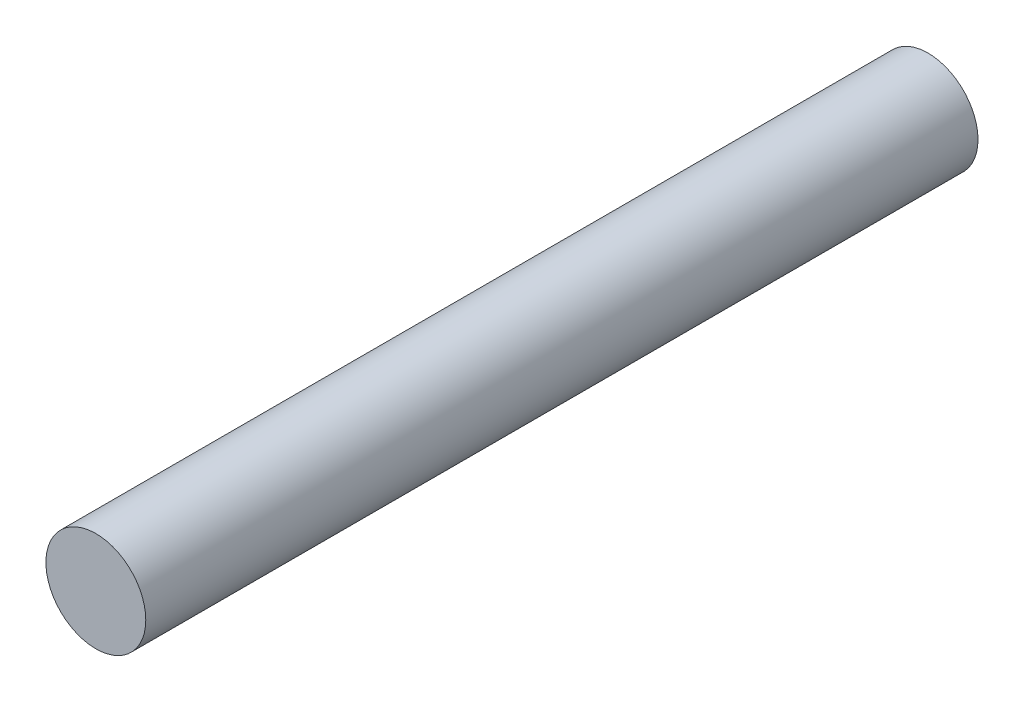
ISO-10303-21;
HEADER;
FILE_DESCRIPTION(('STEP AP214'),'2;1');
FILE_NAME('part.step','',(''),(''),'','','');
FILE_SCHEMA(('AUTOMOTIVE_DESIGN { 1 0 10303 214 1 1 1 1 }'));
ENDSEC;
DATA;
#1=APPLICATION_CONTEXT('core data for automotive mechanical design processes');
#2=APPLICATION_PROTOCOL_DEFINITION('international standard','automotive_design',2000,#1);
#3=PRODUCT_CONTEXT('',#1,'mechanical');
#4=PRODUCT('Part','Part','',(#3));
#5=PRODUCT_RELATED_PRODUCT_CATEGORY('part','',(#4));
#6=PRODUCT_DEFINITION_FORMATION('','',#4);
#7=PRODUCT_DEFINITION_CONTEXT('part definition',#1,'design');
#8=PRODUCT_DEFINITION('design','',#6,#7);
#9=PRODUCT_DEFINITION_SHAPE('','',#8);
#10=(LENGTH_UNIT() NAMED_UNIT(*) SI_UNIT(.MILLI.,.METRE.));
#11=(NAMED_UNIT(*) PLANE_ANGLE_UNIT() SI_UNIT($,.RADIAN.));
#12=(NAMED_UNIT(*) SI_UNIT($,.STERADIAN.) SOLID_ANGLE_UNIT());
#13=UNCERTAINTY_MEASURE_WITH_UNIT(LENGTH_MEASURE(1.E-05),#10,'distance_accuracy_value','');
#14=(GEOMETRIC_REPRESENTATION_CONTEXT(3) GLOBAL_UNCERTAINTY_ASSIGNED_CONTEXT((#13)) GLOBAL_UNIT_ASSIGNED_CONTEXT((#10,
#11,#12)) REPRESENTATION_CONTEXT('',''));
#15=CARTESIAN_POINT('',(0.,0.,0.));
#16=DIRECTION('',(0.,0.,1.));
#17=DIRECTION('',(1.,0.,0.));
#18=AXIS2_PLACEMENT_3D('',#15,#16,#17);
#19=CARTESIAN_POINT('',(0.,0.,50.));
#20=DIRECTION('',(0.,0.,-1.));
#21=DIRECTION('',(-1.,0.,0.));
#22=AXIS2_PLACEMENT_3D('',#19,#20,#21);
#23=CYLINDRICAL_SURFACE('',#22,3.);
#24=CARTESIAN_POINT('',(0.,0.,50.));
#25=DIRECTION('',(0.,0.,1.));
#26=DIRECTION('',(1.,0.,0.));
#27=AXIS2_PLACEMENT_3D('',#24,#25,#26);
#28=CIRCLE('',#27,3.);
#29=CARTESIAN_POINT('',(3.,0.,50.));
#30=VERTEX_POINT('',#29);
#31=EDGE_CURVE('E10',#30,#30,#28,.T.);
#32=ORIENTED_EDGE('',*,*,#31,.F.);
#33=EDGE_LOOP('',(#32));
#34=FACE_BOUND('',#33,.T.);
#35=CARTESIAN_POINT('',(0.,0.,0.));
#36=DIRECTION('',(0.,0.,1.));
#37=DIRECTION('',(1.,0.,0.));
#38=AXIS2_PLACEMENT_3D('',#35,#36,#37);
#39=CIRCLE('',#38,3.);
#40=CARTESIAN_POINT('',(3.,0.,0.));
#41=VERTEX_POINT('',#40);
#42=EDGE_CURVE('E36',#41,#41,#39,.T.);
#43=ORIENTED_EDGE('',*,*,#42,.T.);
#44=EDGE_LOOP('',(#43));
#45=FACE_BOUND('',#44,.T.);
#46=ADVANCED_FACE('F33',(#34,#45),#23,.T.);
#47=CARTESIAN_POINT('',(0.,0.,50.));
#48=DIRECTION('',(0.,0.,1.));
#49=DIRECTION('',(1.,0.,0.));
#50=AXIS2_PLACEMENT_3D('',#47,#48,#49);
#51=PLANE('',#50);
#52=ORIENTED_EDGE('',*,*,#31,.T.);
#53=EDGE_LOOP('',(#52));
#54=FACE_BOUND('',#53,.T.);
#55=ADVANCED_FACE('F48',(#54),#51,.T.);
#56=CARTESIAN_POINT('',(0.,0.,0.));
#57=DIRECTION('',(0.,0.,1.));
#58=DIRECTION('',(1.,0.,0.));
#59=AXIS2_PLACEMENT_3D('',#56,#57,#58);
#60=PLANE('',#59);
#61=ORIENTED_EDGE('',*,*,#42,.F.);
#62=EDGE_LOOP('',(#61));
#63=FACE_BOUND('',#62,.T.);
#64=ADVANCED_FACE('F46',(#63),#60,.F.);
#65=CLOSED_SHELL('',(#46,#55,#64));
#66=MANIFOLD_SOLID_BREP('B2',#65);
#67=ADVANCED_BREP_SHAPE_REPRESENTATION('',(#18,#66),#14);
#68=SHAPE_DEFINITION_REPRESENTATION(#9,#67);
ENDSEC;
END-ISO-10303-21;
